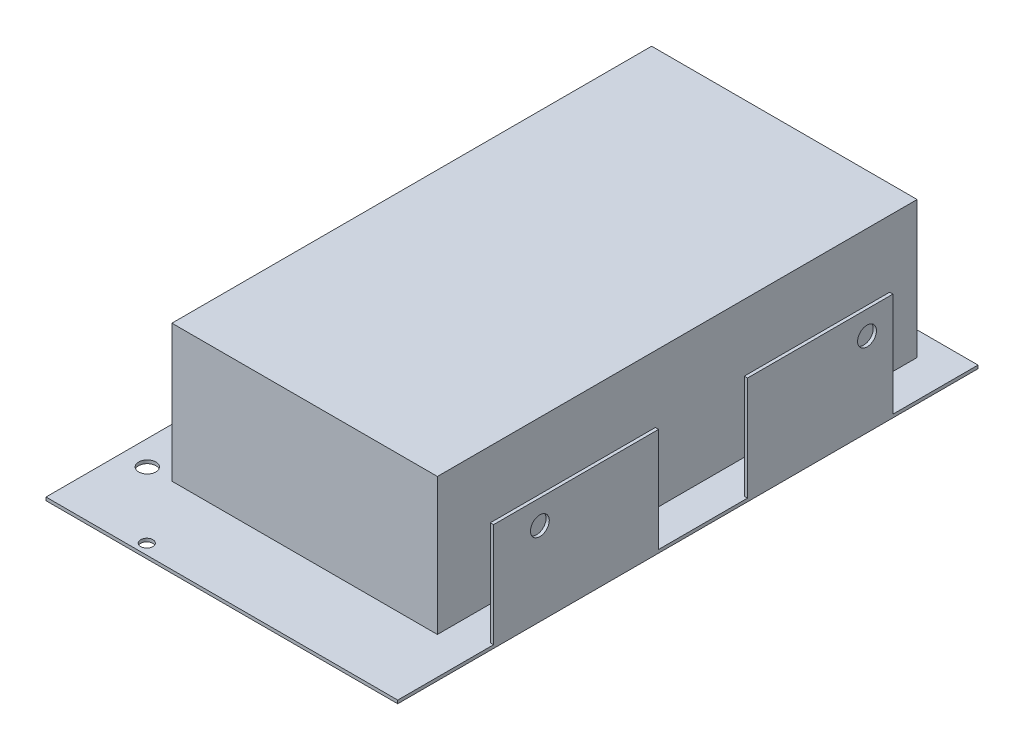
ISO-10303-21;
HEADER;
FILE_DESCRIPTION(('STEP AP214'),'2;1');
FILE_NAME('part.step','',(''),(''),'','','');
FILE_SCHEMA(('AUTOMOTIVE_DESIGN { 1 0 10303 214 1 1 1 1 }'));
ENDSEC;
DATA;
#1=APPLICATION_CONTEXT('core data for automotive mechanical design processes');
#2=APPLICATION_PROTOCOL_DEFINITION('international standard','automotive_design',2000,#1);
#3=PRODUCT_CONTEXT('',#1,'mechanical');
#4=PRODUCT('Part','Part','',(#3));
#5=PRODUCT_RELATED_PRODUCT_CATEGORY('part','',(#4));
#6=PRODUCT_DEFINITION_FORMATION('','',#4);
#7=PRODUCT_DEFINITION_CONTEXT('part definition',#1,'design');
#8=PRODUCT_DEFINITION('design','',#6,#7);
#9=PRODUCT_DEFINITION_SHAPE('','',#8);
#10=(LENGTH_UNIT() NAMED_UNIT(*) SI_UNIT(.MILLI.,.METRE.));
#11=(NAMED_UNIT(*) PLANE_ANGLE_UNIT() SI_UNIT($,.RADIAN.));
#12=(NAMED_UNIT(*) SI_UNIT($,.STERADIAN.) SOLID_ANGLE_UNIT());
#13=UNCERTAINTY_MEASURE_WITH_UNIT(LENGTH_MEASURE(1.E-05),#10,'distance_accuracy_value','');
#14=(GEOMETRIC_REPRESENTATION_CONTEXT(3) GLOBAL_UNCERTAINTY_ASSIGNED_CONTEXT((#13)) GLOBAL_UNIT_ASSIGNED_CONTEXT((#10,
#11,#12)) REPRESENTATION_CONTEXT('',''));
#15=CARTESIAN_POINT('',(0.,0.,0.));
#16=DIRECTION('',(0.,0.,1.));
#17=DIRECTION('',(1.,0.,0.));
#18=AXIS2_PLACEMENT_3D('',#15,#16,#17);
#19=CARTESIAN_POINT('',(0.,1.18,0.));
#20=DIRECTION('',(0.,1.,0.));
#21=DIRECTION('',(0.,0.,1.));
#22=AXIS2_PLACEMENT_3D('',#19,#20,#21);
#23=PLANE('',#22);
#24=CARTESIAN_POINT('',(-31.25,1.18,102.185));
#25=DIRECTION('',(0.,1.,0.));
#26=DIRECTION('',(0.,0.,1.));
#27=AXIS2_PLACEMENT_3D('',#24,#25,#26);
#28=CIRCLE('',#27,2.215);
#29=CARTESIAN_POINT('',(-31.25,1.18,104.4));
#30=VERTEX_POINT('',#29);
#31=EDGE_CURVE('E235',#30,#30,#28,.T.);
#32=ORIENTED_EDGE('',*,*,#31,.F.);
#33=EDGE_LOOP('',(#32));
#34=FACE_BOUND('',#33,.T.);
#35=CARTESIAN_POINT('',(-55.25,1.18,78.));
#36=DIRECTION('',(0.,1.,0.));
#37=DIRECTION('',(0.,0.,1.));
#38=AXIS2_PLACEMENT_3D('',#35,#36,#37);
#39=CIRCLE('',#38,3.15);
#40=CARTESIAN_POINT('',(-55.25,1.18,81.15));
#41=VERTEX_POINT('',#40);
#42=EDGE_CURVE('E241',#41,#41,#39,.T.);
#43=ORIENTED_EDGE('',*,*,#42,.F.);
#44=EDGE_LOOP('',(#43));
#45=FACE_BOUND('',#44,.T.);
#46=DIRECTION('',(1.,0.,0.));
#47=VECTOR('',#46,1.);
#48=CARTESIAN_POINT('',(-46.25,1.18,78.));
#49=LINE('',#48,#47);
#50=CARTESIAN_POINT('',(-46.25,1.18,78.));
#51=VERTEX_POINT('',#50);
#52=CARTESIAN_POINT('',(50.75,1.18,78.));
#53=VERTEX_POINT('',#52);
#54=EDGE_CURVE('E219',#51,#53,#49,.T.);
#55=ORIENTED_EDGE('',*,*,#54,.F.);
#56=DIRECTION('',(0.,0.,1.));
#57=VECTOR('',#56,1.);
#58=CARTESIAN_POINT('',(-46.25,1.18,-97.26));
#59=LINE('',#58,#57);
#60=CARTESIAN_POINT('',(-46.25,1.18,-97.26));
#61=VERTEX_POINT('',#60);
#62=EDGE_CURVE('E205',#61,#51,#59,.T.);
#63=ORIENTED_EDGE('',*,*,#62,.F.);
#64=DIRECTION('',(-1.,0.,0.));
#65=VECTOR('',#64,1.);
#66=CARTESIAN_POINT('',(-46.25,1.18,-97.26));
#67=LINE('',#66,#65);
#68=CARTESIAN_POINT('',(50.75,1.18,-97.26));
#69=VERTEX_POINT('',#68);
#70=EDGE_CURVE('E210',#69,#61,#67,.T.);
#71=ORIENTED_EDGE('',*,*,#70,.F.);
#72=DIRECTION('',(0.,0.,-1.));
#73=VECTOR('',#72,1.);
#74=CARTESIAN_POINT('',(50.75,1.18,-97.26));
#75=LINE('',#74,#73);
#76=EDGE_CURVE('E221',#53,#69,#75,.T.);
#77=ORIENTED_EDGE('',*,*,#76,.F.);
#78=EDGE_LOOP('',(#55,#63,#71,#77));
#79=FACE_BOUND('',#78,.T.);
#80=DIRECTION('',(0.,0.,1.));
#81=VECTOR('',#80,1.);
#82=CARTESIAN_POINT('',(63.07,1.18,-74.9));
#83=LINE('',#82,#81);
#84=CARTESIAN_POINT('',(63.07,1.18,-74.9));
#85=VERTEX_POINT('',#84);
#86=CARTESIAN_POINT('',(63.07,1.18,-21.8));
#87=VERTEX_POINT('',#86);
#88=EDGE_CURVE('E50',#85,#87,#83,.T.);
#89=ORIENTED_EDGE('',*,*,#88,.F.);
#90=DIRECTION('',(-1.,0.,0.));
#91=VECTOR('',#90,1.);
#92=CARTESIAN_POINT('',(64.25,1.18,-74.9));
#93=LINE('',#92,#91);
#94=CARTESIAN_POINT('',(64.25,1.18,-74.9));
#95=VERTEX_POINT('',#94);
#96=EDGE_CURVE('E302',#95,#85,#93,.T.);
#97=ORIENTED_EDGE('',*,*,#96,.F.);
#98=DIRECTION('',(0.,0.,-1.));
#99=VECTOR('',#98,1.);
#100=CARTESIAN_POINT('',(64.25,1.18,-106.));
#101=LINE('',#100,#99);
#102=CARTESIAN_POINT('',(64.25,1.18,-106.));
#103=VERTEX_POINT('',#102);
#104=EDGE_CURVE('E169',#95,#103,#101,.T.);
#105=ORIENTED_EDGE('',*,*,#104,.T.);
#106=DIRECTION('',(-1.,0.,0.));
#107=VECTOR('',#106,1.);
#108=CARTESIAN_POINT('',(-64.25,1.18,-106.));
#109=LINE('',#108,#107);
#110=CARTESIAN_POINT('',(-64.25,1.18,-106.));
#111=VERTEX_POINT('',#110);
#112=EDGE_CURVE('E249',#103,#111,#109,.T.);
#113=ORIENTED_EDGE('',*,*,#112,.T.);
#114=DIRECTION('',(0.,0.,1.));
#115=VECTOR('',#114,1.);
#116=CARTESIAN_POINT('',(-64.25,1.18,-106.));
#117=LINE('',#116,#115);
#118=CARTESIAN_POINT('',(-64.25,1.18,106.));
#119=VERTEX_POINT('',#118);
#120=EDGE_CURVE('E252',#111,#119,#117,.T.);
#121=ORIENTED_EDGE('',*,*,#120,.T.);
#122=DIRECTION('',(1.,0.,0.));
#123=VECTOR('',#122,1.);
#124=CARTESIAN_POINT('',(-64.25,1.18,106.));
#125=LINE('',#124,#123);
#126=CARTESIAN_POINT('',(64.25,1.18,106.));
#127=VERTEX_POINT('',#126);
#128=EDGE_CURVE('E254',#119,#127,#125,.T.);
#129=ORIENTED_EDGE('',*,*,#128,.T.);
#130=CARTESIAN_POINT('',(64.25,1.18,71.));
#131=VERTEX_POINT('',#130);
#132=EDGE_CURVE('E247',#127,#131,#101,.T.);
#133=ORIENTED_EDGE('',*,*,#132,.T.);
#134=DIRECTION('',(1.,0.,0.));
#135=VECTOR('',#134,1.);
#136=CARTESIAN_POINT('',(64.25,1.18,71.));
#137=LINE('',#136,#135);
#138=CARTESIAN_POINT('',(63.07,1.18,71.));
#139=VERTEX_POINT('',#138);
#140=EDGE_CURVE('E183',#139,#131,#137,.T.);
#141=ORIENTED_EDGE('',*,*,#140,.F.);
#142=DIRECTION('',(0.,0.,1.));
#143=VECTOR('',#142,1.);
#144=CARTESIAN_POINT('',(63.07,1.18,10.7));
#145=LINE('',#144,#143);
#146=CARTESIAN_POINT('',(63.07,1.18,10.7));
#147=VERTEX_POINT('',#146);
#148=EDGE_CURVE('E173',#147,#139,#145,.T.);
#149=ORIENTED_EDGE('',*,*,#148,.F.);
#150=DIRECTION('',(-1.,0.,0.));
#151=VECTOR('',#150,1.);
#152=CARTESIAN_POINT('',(64.25,1.18,10.7));
#153=LINE('',#152,#151);
#154=CARTESIAN_POINT('',(64.25,1.18,10.7));
#155=VERTEX_POINT('',#154);
#156=EDGE_CURVE('E170',#155,#147,#153,.T.);
#157=ORIENTED_EDGE('',*,*,#156,.F.);
#158=CARTESIAN_POINT('',(64.25,1.18,-21.8));
#159=VERTEX_POINT('',#158);
#160=EDGE_CURVE('E250',#155,#159,#101,.T.);
#161=ORIENTED_EDGE('',*,*,#160,.T.);
#162=DIRECTION('',(1.,0.,0.));
#163=VECTOR('',#162,1.);
#164=CARTESIAN_POINT('',(64.25,1.18,-21.8));
#165=LINE('',#164,#163);
#166=EDGE_CURVE('E55',#87,#159,#165,.T.);
#167=ORIENTED_EDGE('',*,*,#166,.F.);
#168=EDGE_LOOP('',(#89,#97,#105,#113,#121,#129,#133,#141,#149,#157,#161,#167));
#169=FACE_BOUND('',#168,.T.);
#170=ADVANCED_FACE('F35',(#34,#45,#79,#169),#23,.T.);
#171=CARTESIAN_POINT('',(0.,0.,0.));
#172=DIRECTION('',(0.,1.,0.));
#173=DIRECTION('',(0.,0.,1.));
#174=AXIS2_PLACEMENT_3D('',#171,#172,#173);
#175=PLANE('',#174);
#176=CARTESIAN_POINT('',(-55.25,0.,78.));
#177=DIRECTION('',(0.,1.,0.));
#178=DIRECTION('',(0.,0.,1.));
#179=AXIS2_PLACEMENT_3D('',#176,#177,#178);
#180=CIRCLE('',#179,3.15);
#181=CARTESIAN_POINT('',(-55.25,0.,81.15));
#182=VERTEX_POINT('',#181);
#183=EDGE_CURVE('E238',#182,#182,#180,.T.);
#184=ORIENTED_EDGE('',*,*,#183,.T.);
#185=EDGE_LOOP('',(#184));
#186=FACE_BOUND('',#185,.T.);
#187=DIRECTION('',(0.,0.,-1.));
#188=VECTOR('',#187,1.);
#189=CARTESIAN_POINT('',(64.25,0.,-106.));
#190=LINE('',#189,#188);
#191=CARTESIAN_POINT('',(64.25,0.,106.));
#192=VERTEX_POINT('',#191);
#193=CARTESIAN_POINT('',(64.25,0.,-106.));
#194=VERTEX_POINT('',#193);
#195=EDGE_CURVE('E244',#192,#194,#190,.T.);
#196=ORIENTED_EDGE('',*,*,#195,.F.);
#197=DIRECTION('',(1.,0.,0.));
#198=VECTOR('',#197,1.);
#199=CARTESIAN_POINT('',(-64.25,0.,106.));
#200=LINE('',#199,#198);
#201=CARTESIAN_POINT('',(-64.25,0.,106.));
#202=VERTEX_POINT('',#201);
#203=EDGE_CURVE('E262',#202,#192,#200,.T.);
#204=ORIENTED_EDGE('',*,*,#203,.F.);
#205=DIRECTION('',(0.,0.,1.));
#206=VECTOR('',#205,1.);
#207=CARTESIAN_POINT('',(-64.25,0.,-106.));
#208=LINE('',#207,#206);
#209=CARTESIAN_POINT('',(-64.25,0.,-106.));
#210=VERTEX_POINT('',#209);
#211=EDGE_CURVE('E260',#210,#202,#208,.T.);
#212=ORIENTED_EDGE('',*,*,#211,.F.);
#213=DIRECTION('',(-1.,0.,0.));
#214=VECTOR('',#213,1.);
#215=CARTESIAN_POINT('',(-64.25,0.,-106.));
#216=LINE('',#215,#214);
#217=EDGE_CURVE('E258',#194,#210,#216,.T.);
#218=ORIENTED_EDGE('',*,*,#217,.F.);
#219=EDGE_LOOP('',(#196,#204,#212,#218));
#220=FACE_BOUND('',#219,.T.);
#221=CARTESIAN_POINT('',(-31.25,0.,102.185));
#222=DIRECTION('',(0.,1.,0.));
#223=DIRECTION('',(0.,0.,1.));
#224=AXIS2_PLACEMENT_3D('',#221,#222,#223);
#225=CIRCLE('',#224,2.215);
#226=CARTESIAN_POINT('',(-31.25,0.,104.4));
#227=VERTEX_POINT('',#226);
#228=EDGE_CURVE('E234',#227,#227,#225,.T.);
#229=ORIENTED_EDGE('',*,*,#228,.T.);
#230=EDGE_LOOP('',(#229));
#231=FACE_BOUND('',#230,.T.);
#232=ADVANCED_FACE('F280',(#186,#220,#231),#175,.F.);
#233=CARTESIAN_POINT('',(64.25,1.18,-106.));
#234=DIRECTION('',(-1.,0.,0.));
#235=DIRECTION('',(0.,0.,1.));
#236=AXIS2_PLACEMENT_3D('',#233,#234,#235);
#237=PLANE('',#236);
#238=CARTESIAN_POINT('',(64.25,30.64,-65.46));
#239=DIRECTION('',(1.,0.,0.));
#240=DIRECTION('',(0.,0.,-1.));
#241=AXIS2_PLACEMENT_3D('',#238,#239,#240);
#242=CIRCLE('',#241,3.45);
#243=CARTESIAN_POINT('',(64.25,30.64,-68.91));
#244=VERTEX_POINT('',#243);
#245=EDGE_CURVE('E503',#244,#244,#242,.T.);
#246=ORIENTED_EDGE('',*,*,#245,.F.);
#247=EDGE_LOOP('',(#246));
#248=FACE_BOUND('',#247,.T.);
#249=CARTESIAN_POINT('',(64.25,30.38,54.07));
#250=DIRECTION('',(1.,0.,0.));
#251=DIRECTION('',(0.,0.,-1.));
#252=AXIS2_PLACEMENT_3D('',#249,#250,#251);
#253=CIRCLE('',#252,3.44);
#254=CARTESIAN_POINT('',(64.25,30.38,50.63));
#255=VERTEX_POINT('',#254);
#256=EDGE_CURVE('E513',#255,#255,#253,.T.);
#257=ORIENTED_EDGE('',*,*,#256,.F.);
#258=EDGE_LOOP('',(#257));
#259=FACE_BOUND('',#258,.T.);
#260=ORIENTED_EDGE('',*,*,#195,.T.);
#261=DIRECTION('',(0.,-1.,0.));
#262=VECTOR('',#261,1.);
#263=CARTESIAN_POINT('',(64.25,1.18,-106.));
#264=LINE('',#263,#262);
#265=EDGE_CURVE('E11',#103,#194,#264,.T.);
#266=ORIENTED_EDGE('',*,*,#265,.F.);
#267=ORIENTED_EDGE('',*,*,#104,.F.);
#268=DIRECTION('',(0.,-1.,0.));
#269=VECTOR('',#268,1.);
#270=CARTESIAN_POINT('',(64.25,39.18,-74.9));
#271=LINE('',#270,#269);
#272=CARTESIAN_POINT('',(64.25,39.18,-74.9));
#273=VERTEX_POINT('',#272);
#274=EDGE_CURVE('E151',#273,#95,#271,.T.);
#275=ORIENTED_EDGE('',*,*,#274,.F.);
#276=DIRECTION('',(0.,0.,-1.));
#277=VECTOR('',#276,1.);
#278=CARTESIAN_POINT('',(64.25,39.18,-74.9));
#279=LINE('',#278,#277);
#280=CARTESIAN_POINT('',(64.25,39.18,-21.8));
#281=VERTEX_POINT('',#280);
#282=EDGE_CURVE('E157',#281,#273,#279,.T.);
#283=ORIENTED_EDGE('',*,*,#282,.F.);
#284=DIRECTION('',(0.,-1.,0.));
#285=VECTOR('',#284,1.);
#286=CARTESIAN_POINT('',(64.25,39.18,-21.8));
#287=LINE('',#286,#285);
#288=EDGE_CURVE('E301',#281,#159,#287,.T.);
#289=ORIENTED_EDGE('',*,*,#288,.T.);
#290=ORIENTED_EDGE('',*,*,#160,.F.);
#291=DIRECTION('',(0.,-1.,0.));
#292=VECTOR('',#291,1.);
#293=CARTESIAN_POINT('',(64.25,39.18,10.7));
#294=LINE('',#293,#292);
#295=CARTESIAN_POINT('',(64.25,39.18,10.7));
#296=VERTEX_POINT('',#295);
#297=EDGE_CURVE('E202',#296,#155,#294,.T.);
#298=ORIENTED_EDGE('',*,*,#297,.F.);
#299=DIRECTION('',(0.,0.,-1.));
#300=VECTOR('',#299,1.);
#301=CARTESIAN_POINT('',(64.25,39.18,10.7));
#302=LINE('',#301,#300);
#303=CARTESIAN_POINT('',(64.25,39.18,71.));
#304=VERTEX_POINT('',#303);
#305=EDGE_CURVE('E179',#304,#296,#302,.T.);
#306=ORIENTED_EDGE('',*,*,#305,.F.);
#307=DIRECTION('',(0.,-1.,0.));
#308=VECTOR('',#307,1.);
#309=CARTESIAN_POINT('',(64.25,39.18,71.));
#310=LINE('',#309,#308);
#311=EDGE_CURVE('E188',#304,#131,#310,.T.);
#312=ORIENTED_EDGE('',*,*,#311,.T.);
#313=ORIENTED_EDGE('',*,*,#132,.F.);
#314=DIRECTION('',(0.,-1.,0.));
#315=VECTOR('',#314,1.);
#316=CARTESIAN_POINT('',(64.25,1.18,106.));
#317=LINE('',#316,#315);
#318=EDGE_CURVE('E256',#127,#192,#317,.T.);
#319=ORIENTED_EDGE('',*,*,#318,.T.);
#320=EDGE_LOOP('',(#260,#266,#267,#275,#283,#289,#290,#298,#306,#312,#313,#319));
#321=FACE_BOUND('',#320,.T.);
#322=ADVANCED_FACE('F37',(#248,#259,#321),#237,.F.);
#323=CARTESIAN_POINT('',(-64.25,1.18,-106.));
#324=DIRECTION('',(0.,0.,1.));
#325=DIRECTION('',(1.,0.,0.));
#326=AXIS2_PLACEMENT_3D('',#323,#324,#325);
#327=PLANE('',#326);
#328=ORIENTED_EDGE('',*,*,#217,.T.);
#329=DIRECTION('',(0.,-1.,0.));
#330=VECTOR('',#329,1.);
#331=CARTESIAN_POINT('',(-64.25,1.18,-106.));
#332=LINE('',#331,#330);
#333=EDGE_CURVE('E43',#111,#210,#332,.T.);
#334=ORIENTED_EDGE('',*,*,#333,.F.);
#335=ORIENTED_EDGE('',*,*,#112,.F.);
#336=ORIENTED_EDGE('',*,*,#265,.T.);
#337=EDGE_LOOP('',(#328,#334,#335,#336));
#338=FACE_BOUND('',#337,.T.);
#339=ADVANCED_FACE('F303',(#338),#327,.F.);
#340=CARTESIAN_POINT('',(-64.25,1.18,-106.));
#341=DIRECTION('',(1.,0.,0.));
#342=DIRECTION('',(0.,0.,-1.));
#343=AXIS2_PLACEMENT_3D('',#340,#341,#342);
#344=PLANE('',#343);
#345=ORIENTED_EDGE('',*,*,#211,.T.);
#346=DIRECTION('',(0.,-1.,0.));
#347=VECTOR('',#346,1.);
#348=CARTESIAN_POINT('',(-64.25,1.18,106.));
#349=LINE('',#348,#347);
#350=EDGE_CURVE('E266',#119,#202,#349,.T.);
#351=ORIENTED_EDGE('',*,*,#350,.F.);
#352=ORIENTED_EDGE('',*,*,#120,.F.);
#353=ORIENTED_EDGE('',*,*,#333,.T.);
#354=EDGE_LOOP('',(#345,#351,#352,#353));
#355=FACE_BOUND('',#354,.T.);
#356=ADVANCED_FACE('F273',(#355),#344,.F.);
#357=CARTESIAN_POINT('',(-64.25,1.18,106.));
#358=DIRECTION('',(0.,0.,-1.));
#359=DIRECTION('',(-1.,0.,0.));
#360=AXIS2_PLACEMENT_3D('',#357,#358,#359);
#361=PLANE('',#360);
#362=ORIENTED_EDGE('',*,*,#203,.T.);
#363=ORIENTED_EDGE('',*,*,#318,.F.);
#364=ORIENTED_EDGE('',*,*,#128,.F.);
#365=ORIENTED_EDGE('',*,*,#350,.T.);
#366=EDGE_LOOP('',(#362,#363,#364,#365));
#367=FACE_BOUND('',#366,.T.);
#368=ADVANCED_FACE('F284',(#367),#361,.F.);
#369=CARTESIAN_POINT('',(-55.25,1.18,78.));
#370=DIRECTION('',(0.,-1.,0.));
#371=DIRECTION('',(0.,0.,-1.));
#372=AXIS2_PLACEMENT_3D('',#369,#370,#371);
#373=CYLINDRICAL_SURFACE('',#372,3.15);
#374=ORIENTED_EDGE('',*,*,#42,.T.);
#375=EDGE_LOOP('',(#374));
#376=FACE_BOUND('',#375,.T.);
#377=ORIENTED_EDGE('',*,*,#183,.F.);
#378=EDGE_LOOP('',(#377));
#379=FACE_BOUND('',#378,.T.);
#380=ADVANCED_FACE('F322',(#376,#379),#373,.F.);
#381=CARTESIAN_POINT('',(-31.25,1.18,102.185));
#382=DIRECTION('',(0.,-1.,0.));
#383=DIRECTION('',(0.,0.,-1.));
#384=AXIS2_PLACEMENT_3D('',#381,#382,#383);
#385=CYLINDRICAL_SURFACE('',#384,2.215);
#386=ORIENTED_EDGE('',*,*,#31,.T.);
#387=EDGE_LOOP('',(#386));
#388=FACE_BOUND('',#387,.T.);
#389=ORIENTED_EDGE('',*,*,#228,.F.);
#390=EDGE_LOOP('',(#389));
#391=FACE_BOUND('',#390,.T.);
#392=ADVANCED_FACE('F329',(#388,#391),#385,.F.);
#393=CARTESIAN_POINT('',(-46.25,51.18,-97.26));
#394=DIRECTION('',(1.,0.,0.));
#395=DIRECTION('',(0.,0.,-1.));
#396=AXIS2_PLACEMENT_3D('',#393,#394,#395);
#397=PLANE('',#396);
#398=ORIENTED_EDGE('',*,*,#62,.T.);
#399=DIRECTION('',(0.,-1.,0.));
#400=VECTOR('',#399,1.);
#401=CARTESIAN_POINT('',(-46.25,51.18,78.));
#402=LINE('',#401,#400);
#403=CARTESIAN_POINT('',(-46.25,51.18,78.));
#404=VERTEX_POINT('',#403);
#405=EDGE_CURVE('E232',#404,#51,#402,.T.);
#406=ORIENTED_EDGE('',*,*,#405,.F.);
#407=DIRECTION('',(0.,0.,1.));
#408=VECTOR('',#407,1.);
#409=CARTESIAN_POINT('',(-46.25,51.18,-97.26));
#410=LINE('',#409,#408);
#411=CARTESIAN_POINT('',(-46.25,51.18,-97.26));
#412=VERTEX_POINT('',#411);
#413=EDGE_CURVE('E206',#412,#404,#410,.T.);
#414=ORIENTED_EDGE('',*,*,#413,.F.);
#415=DIRECTION('',(0.,-1.,0.));
#416=VECTOR('',#415,1.);
#417=CARTESIAN_POINT('',(-46.25,51.18,-97.26));
#418=LINE('',#417,#416);
#419=EDGE_CURVE('E216',#412,#61,#418,.T.);
#420=ORIENTED_EDGE('',*,*,#419,.T.);
#421=EDGE_LOOP('',(#398,#406,#414,#420));
#422=FACE_BOUND('',#421,.T.);
#423=ADVANCED_FACE('F334',(#422),#397,.F.);
#424=CARTESIAN_POINT('',(-46.25,51.18,78.));
#425=DIRECTION('',(0.,0.,-1.));
#426=DIRECTION('',(-1.,0.,0.));
#427=AXIS2_PLACEMENT_3D('',#424,#425,#426);
#428=PLANE('',#427);
#429=ORIENTED_EDGE('',*,*,#54,.T.);
#430=DIRECTION('',(0.,-1.,0.));
#431=VECTOR('',#430,1.);
#432=CARTESIAN_POINT('',(50.75,51.18,78.));
#433=LINE('',#432,#431);
#434=CARTESIAN_POINT('',(50.75,51.18,78.));
#435=VERTEX_POINT('',#434);
#436=EDGE_CURVE('E229',#435,#53,#433,.T.);
#437=ORIENTED_EDGE('',*,*,#436,.F.);
#438=DIRECTION('',(1.,0.,0.));
#439=VECTOR('',#438,1.);
#440=CARTESIAN_POINT('',(-46.25,51.18,78.));
#441=LINE('',#440,#439);
#442=EDGE_CURVE('E209',#404,#435,#441,.T.);
#443=ORIENTED_EDGE('',*,*,#442,.F.);
#444=ORIENTED_EDGE('',*,*,#405,.T.);
#445=EDGE_LOOP('',(#429,#437,#443,#444));
#446=FACE_BOUND('',#445,.T.);
#447=ADVANCED_FACE('F346',(#446),#428,.F.);
#448=CARTESIAN_POINT('',(50.75,51.18,-97.26));
#449=DIRECTION('',(-1.,0.,0.));
#450=DIRECTION('',(0.,0.,1.));
#451=AXIS2_PLACEMENT_3D('',#448,#449,#450);
#452=PLANE('',#451);
#453=ORIENTED_EDGE('',*,*,#76,.T.);
#454=DIRECTION('',(0.,-1.,0.));
#455=VECTOR('',#454,1.);
#456=CARTESIAN_POINT('',(50.75,51.18,-97.26));
#457=LINE('',#456,#455);
#458=CARTESIAN_POINT('',(50.75,51.18,-97.26));
#459=VERTEX_POINT('',#458);
#460=EDGE_CURVE('E227',#459,#69,#457,.T.);
#461=ORIENTED_EDGE('',*,*,#460,.F.);
#462=DIRECTION('',(0.,0.,-1.));
#463=VECTOR('',#462,1.);
#464=CARTESIAN_POINT('',(50.75,51.18,-97.26));
#465=LINE('',#464,#463);
#466=EDGE_CURVE('E212',#435,#459,#465,.T.);
#467=ORIENTED_EDGE('',*,*,#466,.F.);
#468=ORIENTED_EDGE('',*,*,#436,.T.);
#469=EDGE_LOOP('',(#453,#461,#467,#468));
#470=FACE_BOUND('',#469,.T.);
#471=ADVANCED_FACE('F350',(#470),#452,.F.);
#472=CARTESIAN_POINT('',(-46.25,51.18,-97.26));
#473=DIRECTION('',(0.,0.,1.));
#474=DIRECTION('',(1.,0.,0.));
#475=AXIS2_PLACEMENT_3D('',#472,#473,#474);
#476=PLANE('',#475);
#477=ORIENTED_EDGE('',*,*,#70,.T.);
#478=ORIENTED_EDGE('',*,*,#419,.F.);
#479=DIRECTION('',(-1.,0.,0.));
#480=VECTOR('',#479,1.);
#481=CARTESIAN_POINT('',(-46.25,51.18,-97.26));
#482=LINE('',#481,#480);
#483=EDGE_CURVE('E214',#459,#412,#482,.T.);
#484=ORIENTED_EDGE('',*,*,#483,.F.);
#485=ORIENTED_EDGE('',*,*,#460,.T.);
#486=EDGE_LOOP('',(#477,#478,#484,#485));
#487=FACE_BOUND('',#486,.T.);
#488=ADVANCED_FACE('F359',(#487),#476,.F.);
#489=CARTESIAN_POINT('',(0.,51.18,0.));
#490=DIRECTION('',(0.,1.,0.));
#491=DIRECTION('',(0.,0.,1.));
#492=AXIS2_PLACEMENT_3D('',#489,#490,#491);
#493=PLANE('',#492);
#494=ORIENTED_EDGE('',*,*,#413,.T.);
#495=ORIENTED_EDGE('',*,*,#442,.T.);
#496=ORIENTED_EDGE('',*,*,#466,.T.);
#497=ORIENTED_EDGE('',*,*,#483,.T.);
#498=EDGE_LOOP('',(#494,#495,#496,#497));
#499=FACE_BOUND('',#498,.T.);
#500=ADVANCED_FACE('F354',(#499),#493,.T.);
#501=CARTESIAN_POINT('',(64.25,39.18,10.7));
#502=DIRECTION('',(0.,0.,1.));
#503=DIRECTION('',(1.,0.,0.));
#504=AXIS2_PLACEMENT_3D('',#501,#502,#503);
#505=PLANE('',#504);
#506=ORIENTED_EDGE('',*,*,#156,.T.);
#507=DIRECTION('',(0.,-1.,0.));
#508=VECTOR('',#507,1.);
#509=CARTESIAN_POINT('',(63.07,39.18,10.7));
#510=LINE('',#509,#508);
#511=CARTESIAN_POINT('',(63.07,39.18,10.7));
#512=VERTEX_POINT('',#511);
#513=EDGE_CURVE('E199',#512,#147,#510,.T.);
#514=ORIENTED_EDGE('',*,*,#513,.F.);
#515=DIRECTION('',(-1.,0.,0.));
#516=VECTOR('',#515,1.);
#517=CARTESIAN_POINT('',(64.25,39.18,10.7));
#518=LINE('',#517,#516);
#519=EDGE_CURVE('E182',#296,#512,#518,.T.);
#520=ORIENTED_EDGE('',*,*,#519,.F.);
#521=ORIENTED_EDGE('',*,*,#297,.T.);
#522=EDGE_LOOP('',(#506,#514,#520,#521));
#523=FACE_BOUND('',#522,.T.);
#524=ADVANCED_FACE('F299',(#523),#505,.F.);
#525=CARTESIAN_POINT('',(63.07,39.18,10.7));
#526=DIRECTION('',(1.,0.,0.));
#527=DIRECTION('',(0.,0.,-1.));
#528=AXIS2_PLACEMENT_3D('',#525,#526,#527);
#529=PLANE('',#528);
#530=CARTESIAN_POINT('',(63.07,30.38,54.07));
#531=DIRECTION('',(1.,0.,0.));
#532=DIRECTION('',(0.,0.,-1.));
#533=AXIS2_PLACEMENT_3D('',#530,#531,#532);
#534=CIRCLE('',#533,3.44);
#535=CARTESIAN_POINT('',(63.07,30.38,50.63));
#536=VERTEX_POINT('',#535);
#537=EDGE_CURVE('E508',#536,#536,#534,.F.);
#538=ORIENTED_EDGE('',*,*,#537,.F.);
#539=EDGE_LOOP('',(#538));
#540=FACE_BOUND('',#539,.T.);
#541=ORIENTED_EDGE('',*,*,#148,.T.);
#542=DIRECTION('',(0.,-1.,0.));
#543=VECTOR('',#542,1.);
#544=CARTESIAN_POINT('',(63.07,39.18,71.));
#545=LINE('',#544,#543);
#546=CARTESIAN_POINT('',(63.07,39.18,71.));
#547=VERTEX_POINT('',#546);
#548=EDGE_CURVE('E196',#547,#139,#545,.T.);
#549=ORIENTED_EDGE('',*,*,#548,.F.);
#550=DIRECTION('',(0.,0.,1.));
#551=VECTOR('',#550,1.);
#552=CARTESIAN_POINT('',(63.07,39.18,10.7));
#553=LINE('',#552,#551);
#554=EDGE_CURVE('E185',#512,#547,#553,.T.);
#555=ORIENTED_EDGE('',*,*,#554,.F.);
#556=ORIENTED_EDGE('',*,*,#513,.T.);
#557=EDGE_LOOP('',(#541,#549,#555,#556));
#558=FACE_BOUND('',#557,.T.);
#559=ADVANCED_FACE('F295',(#540,#558),#529,.F.);
#560=CARTESIAN_POINT('',(64.25,39.18,71.));
#561=DIRECTION('',(0.,0.,-1.));
#562=DIRECTION('',(-1.,0.,0.));
#563=AXIS2_PLACEMENT_3D('',#560,#561,#562);
#564=PLANE('',#563);
#565=ORIENTED_EDGE('',*,*,#140,.T.);
#566=ORIENTED_EDGE('',*,*,#311,.F.);
#567=DIRECTION('',(1.,0.,0.));
#568=VECTOR('',#567,1.);
#569=CARTESIAN_POINT('',(64.25,39.18,71.));
#570=LINE('',#569,#568);
#571=EDGE_CURVE('E187',#547,#304,#570,.T.);
#572=ORIENTED_EDGE('',*,*,#571,.F.);
#573=ORIENTED_EDGE('',*,*,#548,.T.);
#574=EDGE_LOOP('',(#565,#566,#572,#573));
#575=FACE_BOUND('',#574,.T.);
#576=ADVANCED_FACE('F290',(#575),#564,.F.);
#577=CARTESIAN_POINT('',(0.,39.18,0.));
#578=DIRECTION('',(0.,-1.,0.));
#579=DIRECTION('',(0.,0.,-1.));
#580=AXIS2_PLACEMENT_3D('',#577,#578,#579);
#581=PLANE('',#580);
#582=ORIENTED_EDGE('',*,*,#305,.T.);
#583=ORIENTED_EDGE('',*,*,#519,.T.);
#584=ORIENTED_EDGE('',*,*,#554,.T.);
#585=ORIENTED_EDGE('',*,*,#571,.T.);
#586=EDGE_LOOP('',(#582,#583,#584,#585));
#587=FACE_BOUND('',#586,.T.);
#588=ADVANCED_FACE('F419',(#587),#581,.F.);
#589=CARTESIAN_POINT('',(64.25,39.18,-74.9));
#590=DIRECTION('',(0.,0.,1.));
#591=DIRECTION('',(1.,0.,0.));
#592=AXIS2_PLACEMENT_3D('',#589,#590,#591);
#593=PLANE('',#592);
#594=ORIENTED_EDGE('',*,*,#96,.T.);
#595=DIRECTION('',(0.,-1.,0.));
#596=VECTOR('',#595,1.);
#597=CARTESIAN_POINT('',(63.07,39.18,-74.9));
#598=LINE('',#597,#596);
#599=CARTESIAN_POINT('',(63.07,39.18,-74.9));
#600=VERTEX_POINT('',#599);
#601=EDGE_CURVE('E153',#600,#85,#598,.T.);
#602=ORIENTED_EDGE('',*,*,#601,.F.);
#603=DIRECTION('',(-1.,0.,0.));
#604=VECTOR('',#603,1.);
#605=CARTESIAN_POINT('',(64.25,39.18,-74.9));
#606=LINE('',#605,#604);
#607=EDGE_CURVE('E147',#273,#600,#606,.T.);
#608=ORIENTED_EDGE('',*,*,#607,.F.);
#609=ORIENTED_EDGE('',*,*,#274,.T.);
#610=EDGE_LOOP('',(#594,#602,#608,#609));
#611=FACE_BOUND('',#610,.T.);
#612=ADVANCED_FACE('F149',(#611),#593,.F.);
#613=CARTESIAN_POINT('',(63.07,39.18,-74.9));
#614=DIRECTION('',(1.,0.,0.));
#615=DIRECTION('',(0.,0.,-1.));
#616=AXIS2_PLACEMENT_3D('',#613,#614,#615);
#617=PLANE('',#616);
#618=CARTESIAN_POINT('',(63.07,30.64,-65.46));
#619=DIRECTION('',(1.,0.,0.));
#620=DIRECTION('',(0.,0.,-1.));
#621=AXIS2_PLACEMENT_3D('',#618,#619,#620);
#622=CIRCLE('',#621,3.45);
#623=CARTESIAN_POINT('',(63.07,30.64,-68.91));
#624=VERTEX_POINT('',#623);
#625=EDGE_CURVE('E506',#624,#624,#622,.F.);
#626=ORIENTED_EDGE('',*,*,#625,.F.);
#627=EDGE_LOOP('',(#626));
#628=FACE_BOUND('',#627,.T.);
#629=ORIENTED_EDGE('',*,*,#88,.T.);
#630=DIRECTION('',(0.,-1.,0.));
#631=VECTOR('',#630,1.);
#632=CARTESIAN_POINT('',(63.07,39.18,-21.8));
#633=LINE('',#632,#631);
#634=CARTESIAN_POINT('',(63.07,39.18,-21.8));
#635=VERTEX_POINT('',#634);
#636=EDGE_CURVE('E175',#635,#87,#633,.T.);
#637=ORIENTED_EDGE('',*,*,#636,.F.);
#638=DIRECTION('',(0.,0.,1.));
#639=VECTOR('',#638,1.);
#640=CARTESIAN_POINT('',(63.07,39.18,-74.9));
#641=LINE('',#640,#639);
#642=EDGE_CURVE('E156',#600,#635,#641,.T.);
#643=ORIENTED_EDGE('',*,*,#642,.F.);
#644=ORIENTED_EDGE('',*,*,#601,.T.);
#645=EDGE_LOOP('',(#629,#637,#643,#644));
#646=FACE_BOUND('',#645,.T.);
#647=ADVANCED_FACE('F437',(#628,#646),#617,.F.);
#648=CARTESIAN_POINT('',(64.25,39.18,-21.8));
#649=DIRECTION('',(0.,0.,-1.));
#650=DIRECTION('',(-1.,0.,0.));
#651=AXIS2_PLACEMENT_3D('',#648,#649,#650);
#652=PLANE('',#651);
#653=ORIENTED_EDGE('',*,*,#166,.T.);
#654=ORIENTED_EDGE('',*,*,#288,.F.);
#655=DIRECTION('',(1.,0.,0.));
#656=VECTOR('',#655,1.);
#657=CARTESIAN_POINT('',(64.25,39.18,-21.8));
#658=LINE('',#657,#656);
#659=EDGE_CURVE('E162',#635,#281,#658,.T.);
#660=ORIENTED_EDGE('',*,*,#659,.F.);
#661=ORIENTED_EDGE('',*,*,#636,.T.);
#662=EDGE_LOOP('',(#653,#654,#660,#661));
#663=FACE_BOUND('',#662,.T.);
#664=ADVANCED_FACE('F444',(#663),#652,.F.);
#665=CARTESIAN_POINT('',(0.,39.18,0.));
#666=DIRECTION('',(0.,-1.,0.));
#667=DIRECTION('',(0.,0.,-1.));
#668=AXIS2_PLACEMENT_3D('',#665,#666,#667);
#669=PLANE('',#668);
#670=ORIENTED_EDGE('',*,*,#282,.T.);
#671=ORIENTED_EDGE('',*,*,#607,.T.);
#672=ORIENTED_EDGE('',*,*,#642,.T.);
#673=ORIENTED_EDGE('',*,*,#659,.T.);
#674=EDGE_LOOP('',(#670,#671,#672,#673));
#675=FACE_BOUND('',#674,.T.);
#676=ADVANCED_FACE('F160',(#675),#669,.F.);
#677=CARTESIAN_POINT('',(-64.251,30.38,54.07));
#678=DIRECTION('',(1.,0.,0.));
#679=DIRECTION('',(0.,0.,-1.));
#680=AXIS2_PLACEMENT_3D('',#677,#678,#679);
#681=CYLINDRICAL_SURFACE('',#680,3.44);
#682=ORIENTED_EDGE('',*,*,#256,.T.);
#683=EDGE_LOOP('',(#682));
#684=FACE_BOUND('',#683,.T.);
#685=ORIENTED_EDGE('',*,*,#537,.T.);
#686=EDGE_LOOP('',(#685));
#687=FACE_BOUND('',#686,.T.);
#688=ADVANCED_FACE('F458',(#684,#687),#681,.F.);
#689=CARTESIAN_POINT('',(-64.251,30.64,-65.46));
#690=DIRECTION('',(1.,0.,0.));
#691=DIRECTION('',(0.,0.,-1.));
#692=AXIS2_PLACEMENT_3D('',#689,#690,#691);
#693=CYLINDRICAL_SURFACE('',#692,3.45);
#694=ORIENTED_EDGE('',*,*,#245,.T.);
#695=EDGE_LOOP('',(#694));
#696=FACE_BOUND('',#695,.T.);
#697=ORIENTED_EDGE('',*,*,#625,.T.);
#698=EDGE_LOOP('',(#697));
#699=FACE_BOUND('',#698,.T.);
#700=ADVANCED_FACE('F486',(#696,#699),#693,.F.);
#701=CLOSED_SHELL('',(#170,#232,#322,#339,#356,#368,#380,#392,#423,#447,#471,#488,#500,#524,
#559,#576,#588,#612,#647,#664,#676,#688,#700));
#702=MANIFOLD_SOLID_BREP('B2',#701);
#703=ADVANCED_BREP_SHAPE_REPRESENTATION('',(#18,#702),#14);
#704=SHAPE_DEFINITION_REPRESENTATION(#9,#703);
ENDSEC;
END-ISO-10303-21;
